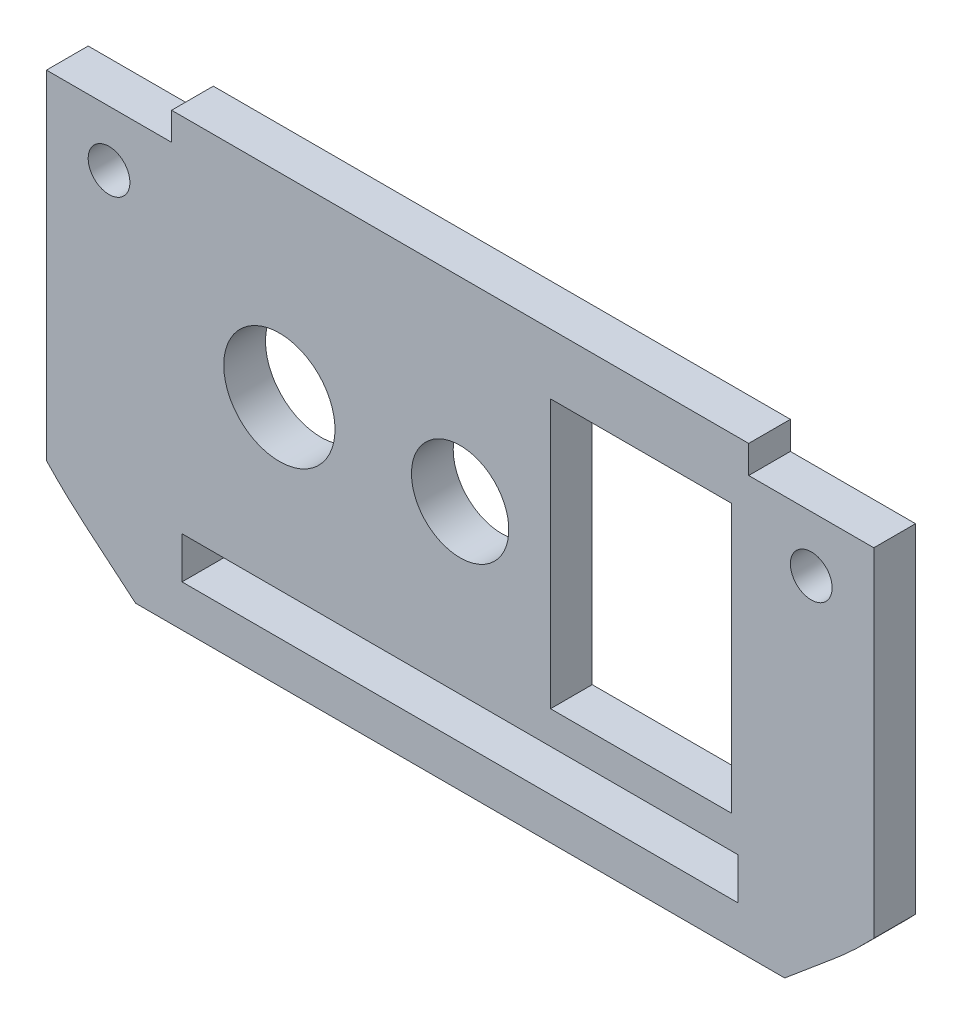
ISO-10303-21;
HEADER;
FILE_DESCRIPTION(('STEP AP214'),'2;1');
FILE_NAME('part.step','',(''),(''),'','','');
FILE_SCHEMA(('AUTOMOTIVE_DESIGN { 1 0 10303 214 1 1 1 1 }'));
ENDSEC;
DATA;
#1=APPLICATION_CONTEXT('core data for automotive mechanical design processes');
#2=APPLICATION_PROTOCOL_DEFINITION('international standard','automotive_design',2000,#1);
#3=PRODUCT_CONTEXT('',#1,'mechanical');
#4=PRODUCT('Part','Part','',(#3));
#5=PRODUCT_RELATED_PRODUCT_CATEGORY('part','',(#4));
#6=PRODUCT_DEFINITION_FORMATION('','',#4);
#7=PRODUCT_DEFINITION_CONTEXT('part definition',#1,'design');
#8=PRODUCT_DEFINITION('design','',#6,#7);
#9=PRODUCT_DEFINITION_SHAPE('','',#8);
#10=(LENGTH_UNIT() NAMED_UNIT(*) SI_UNIT(.MILLI.,.METRE.));
#11=(NAMED_UNIT(*) PLANE_ANGLE_UNIT() SI_UNIT($,.RADIAN.));
#12=(NAMED_UNIT(*) SI_UNIT($,.STERADIAN.) SOLID_ANGLE_UNIT());
#13=UNCERTAINTY_MEASURE_WITH_UNIT(LENGTH_MEASURE(1.E-05),#10,'distance_accuracy_value','');
#14=(GEOMETRIC_REPRESENTATION_CONTEXT(3) GLOBAL_UNCERTAINTY_ASSIGNED_CONTEXT((#13)) GLOBAL_UNIT_ASSIGNED_CONTEXT((#10,
#11,#12)) REPRESENTATION_CONTEXT('',''));
#15=CARTESIAN_POINT('',(0.,0.,0.));
#16=DIRECTION('',(0.,0.,1.));
#17=DIRECTION('',(1.,0.,0.));
#18=AXIS2_PLACEMENT_3D('',#15,#16,#17);
#19=CARTESIAN_POINT('',(-26.9147871056435,19.9999051588187,-64.));
#20=CARTESIAN_POINT('',(-27.7263783854368,20.6837901982728,-64.));
#21=CARTESIAN_POINT('',(-28.5074760571747,21.4052760032748,-64.));
#22=CARTESIAN_POINT('',(-29.6320884436386,22.5455010934507,-64.));
#23=CARTESIAN_POINT('',(-29.9994890597334,22.9357634256907,-64.));
#24=CARTESIAN_POINT('',(-30.7111677982728,23.7276450774803,-64.));
#25=CARTESIAN_POINT('',(-31.056390589223,24.1301732063029,-64.));
#26=CARTESIAN_POINT('',(-32.7307678619733,26.1749150780016,-64.));
#27=CARTESIAN_POINT('',(-33.9054235702185,27.9129911781034,-64.));
#28=CARTESIAN_POINT('',(-35.4370529185161,30.663033957717,-64.));
#29=CARTESIAN_POINT('',(-35.9090631771433,31.6036234918308,-64.));
#30=CARTESIAN_POINT('',(-36.5601593634581,33.0498246354187,-64.));
#31=CARTESIAN_POINT('',(-36.7676964496526,33.5377830619094,-64.));
#32=CARTESIAN_POINT('',(-37.1638236025164,34.5254560338053,-64.));
#33=CARTESIAN_POINT('',(-37.3527321165073,35.0261843238031,-64.));
#34=CARTESIAN_POINT('',(-38.241894145805,37.5356980617039,-64.));
#35=CARTESIAN_POINT('',(-38.783577783586,39.5758711851959,-64.));
#36=CARTESIAN_POINT('',(-39.5680102283546,43.7135954817233,-64.));
#37=CARTESIAN_POINT('',(-39.8105153944841,45.8111934195909,-64.));
#38=CARTESIAN_POINT('',(-39.9359593066346,48.4672964854949,-64.));
#39=CARTESIAN_POINT('',(-39.9520966790366,49.0010057548321,-64.));
#40=CARTESIAN_POINT('',(-39.9665148443424,50.0644891799601,-64.));
#41=CARTESIAN_POINT('',(-39.9648557451864,50.5949815026014,-64.));
#42=CARTESIAN_POINT('',(-39.934049520086,52.1828195733311,-64.));
#43=CARTESIAN_POINT('',(-39.8791184395872,53.2365327602382,-64.));
#44=CARTESIAN_POINT('',(-39.6155682191941,56.3837589870996,-64.));
#45=CARTESIAN_POINT('',(-39.3087856575709,58.4634423162366,-64.));
#46=CARTESIAN_POINT('',(-38.6577427455927,61.5560768044029,-64.));
#47=CARTESIAN_POINT('',(-38.4087641133722,62.5824516866966,-64.));
#48=CARTESIAN_POINT('',(-37.8460178820894,64.6260736859738,-64.));
#49=CARTESIAN_POINT('',(-37.5310957472868,65.6463695367028,-64.));
#50=CARTESIAN_POINT('',(-36.4979772714649,68.6600137755123,-64.));
#51=CARTESIAN_POINT('',(-35.6912963935416,70.6120673433714,-64.));
#52=CARTESIAN_POINT('',(-33.8409200111907,74.4015358865007,-64.));
#53=CARTESIAN_POINT('',(-32.797307350847,76.238990931573,-64.));
#54=CARTESIAN_POINT('',(-31.0399427001826,78.902333742169,-64.));
#55=CARTESIAN_POINT('',(-30.4227353795014,79.7729619306567,-64.));
#56=CARTESIAN_POINT('',(-29.1380523884232,81.4593798872022,-64.));
#57=CARTESIAN_POINT('',(-28.4687965857102,82.2779547463279,-64.));
#58=CARTESIAN_POINT('',(-26.3782730148487,84.6579342874506,-64.));
#59=CARTESIAN_POINT('',(-24.8748626576752,86.1441555247462,-64.));
#60=CARTESIAN_POINT('',(-22.8436515629014,87.8628570149147,-64.));
#61=CARTESIAN_POINT('',(-22.4290326254577,88.2001345055176,-64.));
#62=CARTESIAN_POINT('',(-21.5901963174969,88.8553966799873,-64.));
#63=CARTESIAN_POINT('',(-21.1654767502193,89.1738524529993,-64.));
#64=CARTESIAN_POINT('',(-19.8753255538373,90.1015410843974,-64.));
#65=CARTESIAN_POINT('',(-18.9939253915578,90.6831367258109,-64.));
#66=CARTESIAN_POINT('',(-16.2842870468736,92.3146683963791,-64.));
#67=CARTESIAN_POINT('',(-14.3911136494724,93.2522191108437,-64.));
#68=CARTESIAN_POINT('',(-11.9045766109677,94.2163482662952,-64.));
#69=CARTESIAN_POINT('',(-11.4019550753719,94.3983555555006,-64.));
#70=CARTESIAN_POINT('',(-10.3947386629292,94.7375341044203,-64.));
#71=CARTESIAN_POINT('',(-9.88894348756207,94.8951828230704,-64.));
#72=CARTESIAN_POINT('',(-8.36502593287748,95.3324649862298,-64.));
#73=CARTESIAN_POINT('',(-7.34038135903955,95.5764881306002,-64.));
#74=CARTESIAN_POINT('',(-4.24022566275928,96.1653891272729,-64.));
#75=CARTESIAN_POINT('',(-2.13867647537971,96.3681026659338,-64.));
#76=CARTESIAN_POINT('',(6.19693653909944E-07,96.3681028490923,-64.));
#77=B_SPLINE_CURVE_WITH_KNOTS('',3,(#19,#20,#21,#22,#23,#24,#25,#26,#27,#28,#29,#30,#31,#32,#33,
#34,#35,#36,#37,#38,#39,#40,#41,#42,#43,#44,#45,#46,#47,#48,#49,#50,#51,#52,#53,#54,#55,#56,#57,
#58,#59,#60,#61,#62,#63,#64,#65,#66,#67,#68,#69,#70,#71,#72,#73,#74,#75,#76),.UNSPECIFIED.,.F.,
.F.,(4,2,2,2,2,2,2,2,2,2,2,2,2,2,2,2,2,2,2,2,2,2,2,2,2,2,2,2,4),(0.,0.03125,0.0468750000000001,
0.0625000000000001,0.125,0.15625,0.171875,0.1875,0.25,0.3125,0.328125,0.34375,0.375,0.4375,
0.46875,0.5,0.5625,0.625,0.65625,0.6875,0.75,0.765625,0.78125,0.8125,0.875,0.890625,0.90625,
0.9375,1.),.UNSPECIFIED.);
#78=DIRECTION('',(0.,0.,-1.));
#79=VECTOR('',#78,1.);
#80=SURFACE_OF_LINEAR_EXTRUSION('',#77,#79);
#81=CARTESIAN_POINT('',(-29.75,22.675446625781,-67.));
#82=CARTESIAN_POINT('',(-29.5874373711386,22.5037062389001,-67.));
#83=CARTESIAN_POINT('',(-29.4230585156449,22.3335692568777,-67.));
#84=CARTESIAN_POINT('',(-28.5075107151427,21.4053111423904,-67.));
#85=CARTESIAN_POINT('',(-27.7264506002728,20.6838569019563,-67.));
#86=CARTESIAN_POINT('',(-26.9148996566454,20.,-67.));
#87=B_SPLINE_CURVE_WITH_KNOTS('',3,(#81,#82,#83,#84,#85,#86),.UNSPECIFIED.,.F.,.F.,(4,2,4),
(1.44457972362649E-06,0.00691386236683072,0.0381624177871071),.UNSPECIFIED.);
#88=CARTESIAN_POINT('',(-26.9148996566455,20.,-67.));
#89=VERTEX_POINT('',#88);
#90=CARTESIAN_POINT('',(-29.7500000000001,22.6754466257809,-67.));
#91=VERTEX_POINT('',#90);
#92=EDGE_CURVE('E281',#89,#91,#87,.F.);
#93=ORIENTED_EDGE('',*,*,#92,.F.);
#94=DIRECTION('',(0.,0.,-1.));
#95=VECTOR('',#94,1.);
#96=CARTESIAN_POINT('',(-26.9148996566455,20.,-64.));
#97=LINE('',#96,#95);
#98=CARTESIAN_POINT('',(-26.9148996566455,20.,-64.));
#99=VERTEX_POINT('',#98);
#100=EDGE_CURVE('E11',#99,#89,#97,.T.);
#101=ORIENTED_EDGE('',*,*,#100,.F.);
#102=CARTESIAN_POINT('',(-26.9148996566454,20.,-64.0000000000001));
#103=CARTESIAN_POINT('',(-27.7264506002728,20.6838569019563,-64.0000000000001));
#104=CARTESIAN_POINT('',(-28.5075107151427,21.4053111423904,-64.));
#105=CARTESIAN_POINT('',(-29.4230585156449,22.3335692568777,-64.));
#106=CARTESIAN_POINT('',(-29.5874373711386,22.5037062389001,-64.));
#107=CARTESIAN_POINT('',(-29.75,22.675446625781,-64.));
#108=B_SPLINE_CURVE_WITH_KNOTS('',3,(#102,#103,#104,#105,#106,#107),.UNSPECIFIED.,.F.,.F.,(4,2,
4),(1.44457972362684E-06,0.03125,0.0381624177871071),.UNSPECIFIED.);
#109=CARTESIAN_POINT('',(-29.7500000000001,22.6754466257809,-64.));
#110=VERTEX_POINT('',#109);
#111=EDGE_CURVE('E350',#99,#110,#108,.T.);
#112=ORIENTED_EDGE('',*,*,#111,.T.);
#113=DIRECTION('',(0.,0.,-1.));
#114=VECTOR('',#113,1.);
#115=CARTESIAN_POINT('',(-29.7500000000001,22.6754466257809,-64.));
#116=LINE('',#115,#114);
#117=EDGE_CURVE('E345',#110,#91,#116,.T.);
#118=ORIENTED_EDGE('',*,*,#117,.T.);
#119=EDGE_LOOP('',(#93,#101,#112,#118));
#120=FACE_BOUND('',#119,.T.);
#121=ADVANCED_FACE('F33',(#120),#80,.T.);
#122=CARTESIAN_POINT('',(-23.3396388788628,17.,-64.));
#123=DIRECTION('',(-0.642787609686534,-0.766044443118982,0.));
#124=DIRECTION('',(0.766044443118982,-0.642787609686534,0.));
#125=AXIS2_PLACEMENT_3D('',#122,#123,#124);
#126=PLANE('',#125);
#127=DIRECTION('',(-0.766044443118982,0.642787609686534,0.));
#128=VECTOR('',#127,1.);
#129=CARTESIAN_POINT('',(-23.3396388788628,17.,-67.));
#130=LINE('',#129,#128);
#131=CARTESIAN_POINT('',(-23.3396388788628,17.,-67.));
#132=VERTEX_POINT('',#131);
#133=EDGE_CURVE('E333',#132,#89,#130,.T.);
#134=ORIENTED_EDGE('',*,*,#133,.F.);
#135=DIRECTION('',(0.,0.,-1.));
#136=VECTOR('',#135,1.);
#137=CARTESIAN_POINT('',(-23.3396388788628,17.,-64.));
#138=LINE('',#137,#136);
#139=CARTESIAN_POINT('',(-23.3396388788628,17.,-64.));
#140=VERTEX_POINT('',#139);
#141=EDGE_CURVE('E45',#140,#132,#138,.T.);
#142=ORIENTED_EDGE('',*,*,#141,.F.);
#143=DIRECTION('',(-0.766044443118982,0.642787609686534,0.));
#144=VECTOR('',#143,1.);
#145=CARTESIAN_POINT('',(-23.3396388788628,17.,-64.));
#146=LINE('',#145,#144);
#147=EDGE_CURVE('E312',#140,#99,#146,.T.);
#148=ORIENTED_EDGE('',*,*,#147,.T.);
#149=ORIENTED_EDGE('',*,*,#100,.T.);
#150=EDGE_LOOP('',(#134,#142,#148,#149));
#151=FACE_BOUND('',#150,.T.);
#152=ADVANCED_FACE('F382',(#151),#126,.T.);
#153=CARTESIAN_POINT('',(0.,17.,-64.));
#154=DIRECTION('',(0.,-1.,0.));
#155=DIRECTION('',(1.,0.,0.));
#156=AXIS2_PLACEMENT_3D('',#153,#154,#155);
#157=PLANE('',#156);
#158=DIRECTION('',(-1.,0.,0.));
#159=VECTOR('',#158,1.);
#160=CARTESIAN_POINT('',(0.,17.,-67.));
#161=LINE('',#160,#159);
#162=CARTESIAN_POINT('',(23.3396388788628,17.,-67.));
#163=VERTEX_POINT('',#162);
#164=EDGE_CURVE('E330',#163,#132,#161,.T.);
#165=ORIENTED_EDGE('',*,*,#164,.F.);
#166=DIRECTION('',(0.,0.,-1.));
#167=VECTOR('',#166,1.);
#168=CARTESIAN_POINT('',(23.3396388788628,17.,-64.));
#169=LINE('',#168,#167);
#170=CARTESIAN_POINT('',(23.3396388788628,17.,-64.));
#171=VERTEX_POINT('',#170);
#172=EDGE_CURVE('E443',#171,#163,#169,.T.);
#173=ORIENTED_EDGE('',*,*,#172,.F.);
#174=DIRECTION('',(-1.,0.,0.));
#175=VECTOR('',#174,1.);
#176=CARTESIAN_POINT('',(0.,17.,-64.));
#177=LINE('',#176,#175);
#178=EDGE_CURVE('E309',#171,#140,#177,.T.);
#179=ORIENTED_EDGE('',*,*,#178,.T.);
#180=ORIENTED_EDGE('',*,*,#141,.T.);
#181=EDGE_LOOP('',(#165,#173,#179,#180));
#182=FACE_BOUND('',#181,.T.);
#183=ADVANCED_FACE('F509',(#182),#157,.T.);
#184=CARTESIAN_POINT('',(-20.,20.,-64.));
#185=DIRECTION('',(0.,1.,0.));
#186=DIRECTION('',(0.,0.,1.));
#187=AXIS2_PLACEMENT_3D('',#184,#185,#186);
#188=PLANE('',#187);
#189=DIRECTION('',(1.,0.,0.));
#190=VECTOR('',#189,1.);
#191=CARTESIAN_POINT('',(-20.,20.,-67.));
#192=LINE('',#191,#190);
#193=CARTESIAN_POINT('',(-20.,20.,-67.));
#194=VERTEX_POINT('',#193);
#195=CARTESIAN_POINT('',(20.,20.,-67.));
#196=VERTEX_POINT('',#195);
#197=EDGE_CURVE('E328',#194,#196,#192,.T.);
#198=ORIENTED_EDGE('',*,*,#197,.F.);
#199=DIRECTION('',(0.,0.,-1.));
#200=VECTOR('',#199,1.);
#201=CARTESIAN_POINT('',(-20.,20.,-64.));
#202=LINE('',#201,#200);
#203=CARTESIAN_POINT('',(-20.,20.,-64.));
#204=VERTEX_POINT('',#203);
#205=EDGE_CURVE('E335',#204,#194,#202,.T.);
#206=ORIENTED_EDGE('',*,*,#205,.F.);
#207=DIRECTION('',(1.,0.,0.));
#208=VECTOR('',#207,1.);
#209=CARTESIAN_POINT('',(-20.,20.,-64.));
#210=LINE('',#209,#208);
#211=CARTESIAN_POINT('',(20.,20.,-64.));
#212=VERTEX_POINT('',#211);
#213=EDGE_CURVE('E307',#204,#212,#210,.T.);
#214=ORIENTED_EDGE('',*,*,#213,.T.);
#215=DIRECTION('',(0.,0.,-1.));
#216=VECTOR('',#215,1.);
#217=CARTESIAN_POINT('',(20.,20.,-64.));
#218=LINE('',#217,#216);
#219=EDGE_CURVE('E446',#212,#196,#218,.T.);
#220=ORIENTED_EDGE('',*,*,#219,.T.);
#221=EDGE_LOOP('',(#198,#206,#214,#220));
#222=FACE_BOUND('',#221,.T.);
#223=ADVANCED_FACE('F529',(#222),#188,.T.);
#224=CARTESIAN_POINT('',(-20.,23.,-64.));
#225=DIRECTION('',(1.,0.,0.));
#226=DIRECTION('',(0.,0.,-1.));
#227=AXIS2_PLACEMENT_3D('',#224,#225,#226);
#228=PLANE('',#227);
#229=DIRECTION('',(0.,-1.,0.));
#230=VECTOR('',#229,1.);
#231=CARTESIAN_POINT('',(-20.,23.,-67.));
#232=LINE('',#231,#230);
#233=CARTESIAN_POINT('',(-20.,23.,-67.));
#234=VERTEX_POINT('',#233);
#235=EDGE_CURVE('E325',#234,#194,#232,.T.);
#236=ORIENTED_EDGE('',*,*,#235,.F.);
#237=DIRECTION('',(0.,0.,-1.));
#238=VECTOR('',#237,1.);
#239=CARTESIAN_POINT('',(-20.,23.,-64.));
#240=LINE('',#239,#238);
#241=CARTESIAN_POINT('',(-20.,23.,-64.));
#242=VERTEX_POINT('',#241);
#243=EDGE_CURVE('E337',#242,#234,#240,.T.);
#244=ORIENTED_EDGE('',*,*,#243,.F.);
#245=DIRECTION('',(0.,-1.,0.));
#246=VECTOR('',#245,1.);
#247=CARTESIAN_POINT('',(-20.,23.,-64.));
#248=LINE('',#247,#246);
#249=EDGE_CURVE('E304',#242,#204,#248,.T.);
#250=ORIENTED_EDGE('',*,*,#249,.T.);
#251=ORIENTED_EDGE('',*,*,#205,.T.);
#252=EDGE_LOOP('',(#236,#244,#250,#251));
#253=FACE_BOUND('',#252,.T.);
#254=ADVANCED_FACE('F533',(#253),#228,.T.);
#255=CARTESIAN_POINT('',(0.,23.,-64.));
#256=DIRECTION('',(0.,-1.,0.));
#257=DIRECTION('',(0.,0.,-1.));
#258=AXIS2_PLACEMENT_3D('',#255,#256,#257);
#259=PLANE('',#258);
#260=DIRECTION('',(-1.,0.,0.));
#261=VECTOR('',#260,1.);
#262=CARTESIAN_POINT('',(0.,23.,-67.));
#263=LINE('',#262,#261);
#264=CARTESIAN_POINT('',(20.,23.,-67.));
#265=VERTEX_POINT('',#264);
#266=EDGE_CURVE('E322',#265,#234,#263,.T.);
#267=ORIENTED_EDGE('',*,*,#266,.F.);
#268=DIRECTION('',(0.,0.,-1.));
#269=VECTOR('',#268,1.);
#270=CARTESIAN_POINT('',(20.,23.,-64.));
#271=LINE('',#270,#269);
#272=CARTESIAN_POINT('',(20.,23.,-64.));
#273=VERTEX_POINT('',#272);
#274=EDGE_CURVE('E449',#273,#265,#271,.T.);
#275=ORIENTED_EDGE('',*,*,#274,.F.);
#276=DIRECTION('',(-1.,0.,0.));
#277=VECTOR('',#276,1.);
#278=CARTESIAN_POINT('',(0.,23.,-64.));
#279=LINE('',#278,#277);
#280=EDGE_CURVE('E301',#273,#242,#279,.T.);
#281=ORIENTED_EDGE('',*,*,#280,.T.);
#282=ORIENTED_EDGE('',*,*,#243,.T.);
#283=EDGE_LOOP('',(#267,#275,#281,#282));
#284=FACE_BOUND('',#283,.T.);
#285=ADVANCED_FACE('F539',(#284),#259,.T.);
#286=CARTESIAN_POINT('',(0.,49.,-64.));
#287=DIRECTION('',(0.,1.,0.));
#288=DIRECTION('',(0.,0.,1.));
#289=AXIS2_PLACEMENT_3D('',#286,#287,#288);
#290=PLANE('',#289);
#291=DIRECTION('',(1.,0.,0.));
#292=VECTOR('',#291,1.);
#293=CARTESIAN_POINT('',(0.,49.,-67.));
#294=LINE('',#293,#292);
#295=CARTESIAN_POINT('',(-20.7500000000001,49.,-67.));
#296=VERTEX_POINT('',#295);
#297=CARTESIAN_POINT('',(20.7500000000001,49.,-67.));
#298=VERTEX_POINT('',#297);
#299=EDGE_CURVE('E320',#296,#298,#294,.T.);
#300=ORIENTED_EDGE('',*,*,#299,.F.);
#301=DIRECTION('',(0.,0.,-1.));
#302=VECTOR('',#301,1.);
#303=CARTESIAN_POINT('',(-20.7500000000001,49.,-64.));
#304=LINE('',#303,#302);
#305=CARTESIAN_POINT('',(-20.7500000000001,49.,-64.));
#306=VERTEX_POINT('',#305);
#307=EDGE_CURVE('E339',#306,#296,#304,.T.);
#308=ORIENTED_EDGE('',*,*,#307,.F.);
#309=DIRECTION('',(1.,0.,0.));
#310=VECTOR('',#309,1.);
#311=CARTESIAN_POINT('',(0.,49.,-64.));
#312=LINE('',#311,#310);
#313=CARTESIAN_POINT('',(20.7500000000001,49.,-64.));
#314=VERTEX_POINT('',#313);
#315=EDGE_CURVE('E299',#306,#314,#312,.T.);
#316=ORIENTED_EDGE('',*,*,#315,.T.);
#317=DIRECTION('',(0.,0.,-1.));
#318=VECTOR('',#317,1.);
#319=CARTESIAN_POINT('',(20.7500000000001,49.,-64.));
#320=LINE('',#319,#318);
#321=EDGE_CURVE('E452',#314,#298,#320,.T.);
#322=ORIENTED_EDGE('',*,*,#321,.T.);
#323=EDGE_LOOP('',(#300,#308,#316,#322));
#324=FACE_BOUND('',#323,.T.);
#325=ADVANCED_FACE('F467',(#324),#290,.T.);
#326=CARTESIAN_POINT('',(-20.7500000000001,49.,-64.));
#327=DIRECTION('',(-1.,0.,0.));
#328=DIRECTION('',(0.,-1.,0.));
#329=AXIS2_PLACEMENT_3D('',#326,#327,#328);
#330=PLANE('',#329);
#331=DIRECTION('',(0.,1.,0.));
#332=VECTOR('',#331,1.);
#333=CARTESIAN_POINT('',(-20.7500000000001,49.,-67.));
#334=LINE('',#333,#332);
#335=CARTESIAN_POINT('',(-20.7500000000001,47.,-67.));
#336=VERTEX_POINT('',#335);
#337=EDGE_CURVE('E316',#336,#296,#334,.T.);
#338=ORIENTED_EDGE('',*,*,#337,.F.);
#339=DIRECTION('',(0.,0.,-1.));
#340=VECTOR('',#339,1.);
#341=CARTESIAN_POINT('',(-20.7500000000001,47.,-64.));
#342=LINE('',#341,#340);
#343=CARTESIAN_POINT('',(-20.7500000000001,47.,-64.));
#344=VERTEX_POINT('',#343);
#345=EDGE_CURVE('E341',#344,#336,#342,.T.);
#346=ORIENTED_EDGE('',*,*,#345,.F.);
#347=DIRECTION('',(0.,1.,0.));
#348=VECTOR('',#347,1.);
#349=CARTESIAN_POINT('',(-20.7500000000001,49.,-64.));
#350=LINE('',#349,#348);
#351=EDGE_CURVE('E295',#344,#306,#350,.T.);
#352=ORIENTED_EDGE('',*,*,#351,.T.);
#353=ORIENTED_EDGE('',*,*,#307,.T.);
#354=EDGE_LOOP('',(#338,#346,#352,#353));
#355=FACE_BOUND('',#354,.T.);
#356=ADVANCED_FACE('F471',(#355),#330,.T.);
#357=CARTESIAN_POINT('',(-20.7500000000001,47.,-64.));
#358=DIRECTION('',(0.,1.,0.));
#359=DIRECTION('',(0.,0.,1.));
#360=AXIS2_PLACEMENT_3D('',#357,#358,#359);
#361=PLANE('',#360);
#362=DIRECTION('',(1.,0.,0.));
#363=VECTOR('',#362,1.);
#364=CARTESIAN_POINT('',(-20.7500000000001,47.,-67.));
#365=LINE('',#364,#363);
#366=CARTESIAN_POINT('',(-29.7500000000001,47.,-67.));
#367=VERTEX_POINT('',#366);
#368=EDGE_CURVE('E313',#367,#336,#365,.T.);
#369=ORIENTED_EDGE('',*,*,#368,.F.);
#370=DIRECTION('',(0.,0.,-1.));
#371=VECTOR('',#370,1.);
#372=CARTESIAN_POINT('',(-29.7500000000001,47.,-64.));
#373=LINE('',#372,#371);
#374=CARTESIAN_POINT('',(-29.7500000000001,47.,-64.));
#375=VERTEX_POINT('',#374);
#376=EDGE_CURVE('E343',#375,#367,#373,.T.);
#377=ORIENTED_EDGE('',*,*,#376,.F.);
#378=DIRECTION('',(1.,0.,0.));
#379=VECTOR('',#378,1.);
#380=CARTESIAN_POINT('',(-20.7500000000001,47.,-64.));
#381=LINE('',#380,#379);
#382=EDGE_CURVE('E289',#375,#344,#381,.T.);
#383=ORIENTED_EDGE('',*,*,#382,.T.);
#384=ORIENTED_EDGE('',*,*,#345,.T.);
#385=EDGE_LOOP('',(#369,#377,#383,#384));
#386=FACE_BOUND('',#385,.T.);
#387=ADVANCED_FACE('F474',(#386),#361,.T.);
#388=CARTESIAN_POINT('',(-29.7500000000001,47.,-64.));
#389=DIRECTION('',(-1.,0.,0.));
#390=DIRECTION('',(0.,-1.,0.));
#391=AXIS2_PLACEMENT_3D('',#388,#389,#390);
#392=PLANE('',#391);
#393=DIRECTION('',(0.,1.,0.));
#394=VECTOR('',#393,1.);
#395=CARTESIAN_POINT('',(-29.7500000000001,47.,-67.));
#396=LINE('',#395,#394);
#397=EDGE_CURVE('E317',#91,#367,#396,.T.);
#398=ORIENTED_EDGE('',*,*,#397,.F.);
#399=ORIENTED_EDGE('',*,*,#117,.F.);
#400=DIRECTION('',(0.,1.,0.));
#401=VECTOR('',#400,1.);
#402=CARTESIAN_POINT('',(-29.7500000000001,47.,-64.));
#403=LINE('',#402,#401);
#404=EDGE_CURVE('E296',#110,#375,#403,.T.);
#405=ORIENTED_EDGE('',*,*,#404,.T.);
#406=ORIENTED_EDGE('',*,*,#376,.T.);
#407=EDGE_LOOP('',(#398,#399,#405,#406));
#408=FACE_BOUND('',#407,.T.);
#409=ADVANCED_FACE('F376',(#408),#392,.T.);
#410=CARTESIAN_POINT('',(-37.1867229220128,66.6509176163059,-64.));
#411=DIRECTION('',(0.,0.,-1.));
#412=DIRECTION('',(-1.,0.,0.));
#413=AXIS2_PLACEMENT_3D('',#410,#411,#412);
#414=PLANE('',#413);
#415=DIRECTION('',(-1.,0.,0.));
#416=VECTOR('',#415,1.);
#417=CARTESIAN_POINT('',(19.5,44.65,-64.));
#418=LINE('',#417,#416);
#419=CARTESIAN_POINT('',(19.5,44.65,-64.));
#420=VERTEX_POINT('',#419);
#421=CARTESIAN_POINT('',(6.50000000000001,44.65,-64.));
#422=VERTEX_POINT('',#421);
#423=EDGE_CURVE('E194',#420,#422,#418,.T.);
#424=ORIENTED_EDGE('',*,*,#423,.F.);
#425=DIRECTION('',(0.,1.,0.));
#426=VECTOR('',#425,1.);
#427=CARTESIAN_POINT('',(19.5,44.65,-64.));
#428=LINE('',#427,#426);
#429=CARTESIAN_POINT('',(19.5,25.35,-64.));
#430=VERTEX_POINT('',#429);
#431=EDGE_CURVE('E176',#430,#420,#428,.T.);
#432=ORIENTED_EDGE('',*,*,#431,.F.);
#433=DIRECTION('',(1.,0.,0.));
#434=VECTOR('',#433,1.);
#435=CARTESIAN_POINT('',(19.5,25.35,-64.));
#436=LINE('',#435,#434);
#437=CARTESIAN_POINT('',(6.5,25.35,-64.));
#438=VERTEX_POINT('',#437);
#439=EDGE_CURVE('E185',#438,#430,#436,.T.);
#440=ORIENTED_EDGE('',*,*,#439,.F.);
#441=DIRECTION('',(0.,-1.,0.));
#442=VECTOR('',#441,1.);
#443=CARTESIAN_POINT('',(6.50000000000001,44.65,-64.));
#444=LINE('',#443,#442);
#445=EDGE_CURVE('E53',#422,#438,#444,.T.);
#446=ORIENTED_EDGE('',*,*,#445,.F.);
#447=EDGE_LOOP('',(#424,#432,#440,#446));
#448=FACE_BOUND('',#447,.T.);
#449=CARTESIAN_POINT('',(-13.,35.,-64.));
#450=DIRECTION('',(0.,0.,-1.));
#451=DIRECTION('',(-1.,0.,0.));
#452=AXIS2_PLACEMENT_3D('',#449,#450,#451);
#453=CIRCLE('',#452,4.);
#454=CARTESIAN_POINT('',(-17.,35.,-64.));
#455=VERTEX_POINT('',#454);
#456=EDGE_CURVE('E213',#455,#455,#453,.F.);
#457=ORIENTED_EDGE('',*,*,#456,.F.);
#458=EDGE_LOOP('',(#457));
#459=FACE_BOUND('',#458,.T.);
#460=CARTESIAN_POINT('',(0.,35.,-64.));
#461=DIRECTION('',(0.,0.,-1.));
#462=DIRECTION('',(-1.,0.,0.));
#463=AXIS2_PLACEMENT_3D('',#460,#461,#462);
#464=CIRCLE('',#463,3.5);
#465=CARTESIAN_POINT('',(-3.5,35.,-64.));
#466=VERTEX_POINT('',#465);
#467=EDGE_CURVE('E219',#466,#466,#464,.F.);
#468=ORIENTED_EDGE('',*,*,#467,.F.);
#469=EDGE_LOOP('',(#468));
#470=FACE_BOUND('',#469,.T.);
#471=ORIENTED_EDGE('',*,*,#178,.F.);
#472=DIRECTION('',(0.766044443118982,0.642787609686534,0.));
#473=VECTOR('',#472,1.);
#474=CARTESIAN_POINT('',(23.3396388788628,17.,-64.));
#475=LINE('',#474,#473);
#476=CARTESIAN_POINT('',(26.9148996566455,20.,-64.));
#477=VERTEX_POINT('',#476);
#478=EDGE_CURVE('E408',#171,#477,#475,.T.);
#479=ORIENTED_EDGE('',*,*,#478,.T.);
#480=CARTESIAN_POINT('',(29.75,22.675446625781,-64.));
#481=CARTESIAN_POINT('',(29.5874373711386,22.5037062389001,-64.));
#482=CARTESIAN_POINT('',(29.4230585156449,22.3335692568777,-64.));
#483=CARTESIAN_POINT('',(28.5075107151427,21.4053111423904,-64.));
#484=CARTESIAN_POINT('',(27.7264506002728,20.6838569019563,-64.0000000000001));
#485=CARTESIAN_POINT('',(26.9148996566454,20.,-64.0000000000001));
#486=B_SPLINE_CURVE_WITH_KNOTS('',3,(#480,#481,#482,#483,#484,#485),.UNSPECIFIED.,.F.,.F.,(4,2,
4),(1.44457972362649E-06,0.00691386236683072,0.0381624177871071),.UNSPECIFIED.);
#487=CARTESIAN_POINT('',(29.7500000000001,22.6754466257809,-64.));
#488=VERTEX_POINT('',#487);
#489=EDGE_CURVE('E269',#477,#488,#486,.F.);
#490=ORIENTED_EDGE('',*,*,#489,.T.);
#491=DIRECTION('',(0.,1.,0.));
#492=VECTOR('',#491,1.);
#493=CARTESIAN_POINT('',(29.7500000000001,47.,-64.));
#494=LINE('',#493,#492);
#495=CARTESIAN_POINT('',(29.7500000000001,47.,-64.));
#496=VERTEX_POINT('',#495);
#497=EDGE_CURVE('E405',#488,#496,#494,.T.);
#498=ORIENTED_EDGE('',*,*,#497,.T.);
#499=DIRECTION('',(-1.,0.,0.));
#500=VECTOR('',#499,1.);
#501=CARTESIAN_POINT('',(20.7500000000001,47.,-64.));
#502=LINE('',#501,#500);
#503=CARTESIAN_POINT('',(20.7500000000001,47.,-64.));
#504=VERTEX_POINT('',#503);
#505=EDGE_CURVE('E233',#496,#504,#502,.T.);
#506=ORIENTED_EDGE('',*,*,#505,.T.);
#507=DIRECTION('',(0.,1.,0.));
#508=VECTOR('',#507,1.);
#509=CARTESIAN_POINT('',(20.7500000000001,49.,-64.));
#510=LINE('',#509,#508);
#511=EDGE_CURVE('E427',#504,#314,#510,.T.);
#512=ORIENTED_EDGE('',*,*,#511,.T.);
#513=ORIENTED_EDGE('',*,*,#315,.F.);
#514=ORIENTED_EDGE('',*,*,#351,.F.);
#515=ORIENTED_EDGE('',*,*,#382,.F.);
#516=ORIENTED_EDGE('',*,*,#404,.F.);
#517=ORIENTED_EDGE('',*,*,#111,.F.);
#518=ORIENTED_EDGE('',*,*,#147,.F.);
#519=EDGE_LOOP('',(#471,#479,#490,#498,#506,#512,#513,#514,#515,#516,#517,#518));
#520=FACE_BOUND('',#519,.T.);
#521=CARTESIAN_POINT('',(-25.25,43.,-64.));
#522=DIRECTION('',(0.,0.,-1.));
#523=DIRECTION('',(-1.,0.,0.));
#524=AXIS2_PLACEMENT_3D('',#521,#522,#523);
#525=CIRCLE('',#524,1.5);
#526=CARTESIAN_POINT('',(-26.75,43.,-64.));
#527=VERTEX_POINT('',#526);
#528=EDGE_CURVE('E278',#527,#527,#525,.T.);
#529=ORIENTED_EDGE('',*,*,#528,.T.);
#530=EDGE_LOOP('',(#529));
#531=FACE_BOUND('',#530,.T.);
#532=DIRECTION('',(0.,-1.,0.));
#533=VECTOR('',#532,1.);
#534=CARTESIAN_POINT('',(20.,23.,-64.));
#535=LINE('',#534,#533);
#536=EDGE_CURVE('E419',#273,#212,#535,.T.);
#537=ORIENTED_EDGE('',*,*,#536,.T.);
#538=ORIENTED_EDGE('',*,*,#213,.F.);
#539=ORIENTED_EDGE('',*,*,#249,.F.);
#540=ORIENTED_EDGE('',*,*,#280,.F.);
#541=EDGE_LOOP('',(#537,#538,#539,#540));
#542=FACE_BOUND('',#541,.T.);
#543=CARTESIAN_POINT('',(25.25,43.,-64.));
#544=DIRECTION('',(0.,0.,1.));
#545=DIRECTION('',(1.,0.,0.));
#546=AXIS2_PLACEMENT_3D('',#543,#544,#545);
#547=CIRCLE('',#546,1.5);
#548=CARTESIAN_POINT('',(26.75,43.,-64.));
#549=VERTEX_POINT('',#548);
#550=EDGE_CURVE('E223',#549,#549,#547,.T.);
#551=ORIENTED_EDGE('',*,*,#550,.F.);
#552=EDGE_LOOP('',(#551));
#553=FACE_BOUND('',#552,.T.);
#554=ADVANCED_FACE('F191',(#448,#459,#470,#520,#531,#542,#553),#414,.F.);
#555=CARTESIAN_POINT('',(-37.1867229220128,66.6509176163059,-67.));
#556=DIRECTION('',(0.,0.,-1.));
#557=DIRECTION('',(-1.,0.,0.));
#558=AXIS2_PLACEMENT_3D('',#555,#556,#557);
#559=PLANE('',#558);
#560=DIRECTION('',(0.,-1.,0.));
#561=VECTOR('',#560,1.);
#562=CARTESIAN_POINT('',(19.5,44.65,-67.));
#563=LINE('',#562,#561);
#564=CARTESIAN_POINT('',(19.5,44.65,-67.));
#565=VERTEX_POINT('',#564);
#566=CARTESIAN_POINT('',(19.5,25.35,-67.));
#567=VERTEX_POINT('',#566);
#568=EDGE_CURVE('E61',#565,#567,#563,.T.);
#569=ORIENTED_EDGE('',*,*,#568,.F.);
#570=DIRECTION('',(1.,0.,0.));
#571=VECTOR('',#570,1.);
#572=CARTESIAN_POINT('',(19.5,44.65,-67.));
#573=LINE('',#572,#571);
#574=CARTESIAN_POINT('',(6.50000000000001,44.65,-67.));
#575=VERTEX_POINT('',#574);
#576=EDGE_CURVE('E182',#575,#565,#573,.T.);
#577=ORIENTED_EDGE('',*,*,#576,.F.);
#578=DIRECTION('',(0.,1.,0.));
#579=VECTOR('',#578,1.);
#580=CARTESIAN_POINT('',(6.50000000000001,44.65,-67.));
#581=LINE('',#580,#579);
#582=CARTESIAN_POINT('',(6.5,25.35,-67.));
#583=VERTEX_POINT('',#582);
#584=EDGE_CURVE('E202',#583,#575,#581,.T.);
#585=ORIENTED_EDGE('',*,*,#584,.F.);
#586=DIRECTION('',(-1.,0.,0.));
#587=VECTOR('',#586,1.);
#588=CARTESIAN_POINT('',(19.5,25.35,-67.));
#589=LINE('',#588,#587);
#590=EDGE_CURVE('E196',#567,#583,#589,.T.);
#591=ORIENTED_EDGE('',*,*,#590,.F.);
#592=EDGE_LOOP('',(#569,#577,#585,#591));
#593=FACE_BOUND('',#592,.T.);
#594=CARTESIAN_POINT('',(-13.,35.,-67.));
#595=DIRECTION('',(0.,0.,-1.));
#596=DIRECTION('',(-1.,0.,0.));
#597=AXIS2_PLACEMENT_3D('',#594,#595,#596);
#598=CIRCLE('',#597,4.);
#599=CARTESIAN_POINT('',(-17.,35.,-67.));
#600=VERTEX_POINT('',#599);
#601=EDGE_CURVE('E188',#600,#600,#598,.T.);
#602=ORIENTED_EDGE('',*,*,#601,.F.);
#603=EDGE_LOOP('',(#602));
#604=FACE_BOUND('',#603,.T.);
#605=CARTESIAN_POINT('',(0.,35.,-67.));
#606=DIRECTION('',(0.,0.,-1.));
#607=DIRECTION('',(-1.,0.,0.));
#608=AXIS2_PLACEMENT_3D('',#605,#606,#607);
#609=CIRCLE('',#608,3.5);
#610=CARTESIAN_POINT('',(-3.5,35.,-67.));
#611=VERTEX_POINT('',#610);
#612=EDGE_CURVE('E216',#611,#611,#609,.T.);
#613=ORIENTED_EDGE('',*,*,#612,.F.);
#614=EDGE_LOOP('',(#613));
#615=FACE_BOUND('',#614,.T.);
#616=DIRECTION('',(0.766044443118982,0.642787609686534,0.));
#617=VECTOR('',#616,1.);
#618=CARTESIAN_POINT('',(23.3396388788628,17.,-67.));
#619=LINE('',#618,#617);
#620=CARTESIAN_POINT('',(26.9148996566455,20.,-67.));
#621=VERTEX_POINT('',#620);
#622=EDGE_CURVE('E262',#163,#621,#619,.T.);
#623=ORIENTED_EDGE('',*,*,#622,.F.);
#624=ORIENTED_EDGE('',*,*,#164,.T.);
#625=ORIENTED_EDGE('',*,*,#133,.T.);
#626=ORIENTED_EDGE('',*,*,#92,.T.);
#627=ORIENTED_EDGE('',*,*,#397,.T.);
#628=ORIENTED_EDGE('',*,*,#368,.T.);
#629=ORIENTED_EDGE('',*,*,#337,.T.);
#630=ORIENTED_EDGE('',*,*,#299,.T.);
#631=DIRECTION('',(0.,1.,0.));
#632=VECTOR('',#631,1.);
#633=CARTESIAN_POINT('',(20.7500000000001,49.,-67.));
#634=LINE('',#633,#632);
#635=CARTESIAN_POINT('',(20.7500000000001,47.,-67.));
#636=VERTEX_POINT('',#635);
#637=EDGE_CURVE('E438',#636,#298,#634,.T.);
#638=ORIENTED_EDGE('',*,*,#637,.F.);
#639=DIRECTION('',(-1.,0.,0.));
#640=VECTOR('',#639,1.);
#641=CARTESIAN_POINT('',(20.7500000000001,47.,-67.));
#642=LINE('',#641,#640);
#643=CARTESIAN_POINT('',(29.7500000000001,47.,-67.));
#644=VERTEX_POINT('',#643);
#645=EDGE_CURVE('E275',#644,#636,#642,.T.);
#646=ORIENTED_EDGE('',*,*,#645,.F.);
#647=DIRECTION('',(0.,1.,0.));
#648=VECTOR('',#647,1.);
#649=CARTESIAN_POINT('',(29.7500000000001,47.,-67.));
#650=LINE('',#649,#648);
#651=CARTESIAN_POINT('',(29.7500000000001,22.6754466257809,-67.));
#652=VERTEX_POINT('',#651);
#653=EDGE_CURVE('E273',#652,#644,#650,.T.);
#654=ORIENTED_EDGE('',*,*,#653,.F.);
#655=CARTESIAN_POINT('',(26.9148996566454,20.,-67.));
#656=CARTESIAN_POINT('',(27.7264506002728,20.6838569019563,-67.));
#657=CARTESIAN_POINT('',(28.5075107151427,21.4053111423904,-67.));
#658=CARTESIAN_POINT('',(29.4230585156449,22.3335692568777,-67.));
#659=CARTESIAN_POINT('',(29.5874373711386,22.5037062389001,-67.));
#660=CARTESIAN_POINT('',(29.75,22.675446625781,-67.));
#661=B_SPLINE_CURVE_WITH_KNOTS('',3,(#655,#656,#657,#658,#659,#660),.UNSPECIFIED.,.F.,.F.,(4,2,
4),(1.44457972362684E-06,0.03125,0.0381624177871071),.UNSPECIFIED.);
#662=EDGE_CURVE('E226',#621,#652,#661,.T.);
#663=ORIENTED_EDGE('',*,*,#662,.F.);
#664=EDGE_LOOP('',(#623,#624,#625,#626,#627,#628,#629,#630,#638,#646,#654,#663));
#665=FACE_BOUND('',#664,.T.);
#666=CARTESIAN_POINT('',(-25.25,43.,-67.));
#667=DIRECTION('',(0.,0.,-1.));
#668=DIRECTION('',(-1.,0.,0.));
#669=AXIS2_PLACEMENT_3D('',#666,#667,#668);
#670=CIRCLE('',#669,1.5);
#671=CARTESIAN_POINT('',(-26.75,43.,-67.));
#672=VERTEX_POINT('',#671);
#673=EDGE_CURVE('E282',#672,#672,#670,.T.);
#674=ORIENTED_EDGE('',*,*,#673,.F.);
#675=EDGE_LOOP('',(#674));
#676=FACE_BOUND('',#675,.T.);
#677=ORIENTED_EDGE('',*,*,#197,.T.);
#678=DIRECTION('',(0.,-1.,0.));
#679=VECTOR('',#678,1.);
#680=CARTESIAN_POINT('',(20.,23.,-67.));
#681=LINE('',#680,#679);
#682=EDGE_CURVE('E270',#265,#196,#681,.T.);
#683=ORIENTED_EDGE('',*,*,#682,.F.);
#684=ORIENTED_EDGE('',*,*,#266,.T.);
#685=ORIENTED_EDGE('',*,*,#235,.T.);
#686=EDGE_LOOP('',(#677,#683,#684,#685));
#687=FACE_BOUND('',#686,.T.);
#688=CARTESIAN_POINT('',(25.25,43.,-67.));
#689=DIRECTION('',(0.,0.,1.));
#690=DIRECTION('',(1.,0.,0.));
#691=AXIS2_PLACEMENT_3D('',#688,#689,#690);
#692=CIRCLE('',#691,1.5);
#693=CARTESIAN_POINT('',(26.75,43.,-67.));
#694=VERTEX_POINT('',#693);
#695=EDGE_CURVE('E222',#694,#694,#692,.T.);
#696=ORIENTED_EDGE('',*,*,#695,.T.);
#697=EDGE_LOOP('',(#696));
#698=FACE_BOUND('',#697,.T.);
#699=ADVANCED_FACE('F375',(#593,#604,#615,#665,#676,#687,#698),#559,.T.);
#700=CARTESIAN_POINT('',(-25.25,43.,-64.));
#701=DIRECTION('',(0.,0.,-1.));
#702=DIRECTION('',(-1.,0.,0.));
#703=AXIS2_PLACEMENT_3D('',#700,#701,#702);
#704=CYLINDRICAL_SURFACE('',#703,1.5);
#705=ORIENTED_EDGE('',*,*,#528,.F.);
#706=EDGE_LOOP('',(#705));
#707=FACE_BOUND('',#706,.T.);
#708=ORIENTED_EDGE('',*,*,#673,.T.);
#709=EDGE_LOOP('',(#708));
#710=FACE_BOUND('',#709,.T.);
#711=ADVANCED_FACE('F245',(#707,#710),#704,.F.);
#712=CARTESIAN_POINT('',(26.9147871056435,19.9999051588187,-64.));
#713=CARTESIAN_POINT('',(27.7263783854368,20.6837901982728,-64.));
#714=CARTESIAN_POINT('',(28.5074760571747,21.4052760032748,-64.));
#715=CARTESIAN_POINT('',(29.6320884436386,22.5455010934507,-64.));
#716=CARTESIAN_POINT('',(29.9994890597334,22.9357634256907,-64.));
#717=CARTESIAN_POINT('',(30.7111677982728,23.7276450774803,-64.));
#718=CARTESIAN_POINT('',(31.056390589223,24.1301732063029,-64.));
#719=CARTESIAN_POINT('',(32.7307678619733,26.1749150780016,-64.));
#720=CARTESIAN_POINT('',(33.9054235702185,27.9129911781034,-64.));
#721=CARTESIAN_POINT('',(35.4370529185161,30.663033957717,-64.));
#722=CARTESIAN_POINT('',(35.9090631771433,31.6036234918308,-64.));
#723=CARTESIAN_POINT('',(36.5601593634581,33.0498246354187,-64.));
#724=CARTESIAN_POINT('',(36.7676964496526,33.5377830619094,-64.));
#725=CARTESIAN_POINT('',(37.1638236025164,34.5254560338053,-64.));
#726=CARTESIAN_POINT('',(37.3527321165073,35.0261843238031,-64.));
#727=CARTESIAN_POINT('',(38.241894145805,37.5356980617039,-64.));
#728=CARTESIAN_POINT('',(38.783577783586,39.5758711851959,-64.));
#729=CARTESIAN_POINT('',(39.5680102283546,43.7135954817233,-64.));
#730=CARTESIAN_POINT('',(39.8105153944841,45.8111934195909,-64.));
#731=CARTESIAN_POINT('',(39.9359593066346,48.4672964854949,-64.));
#732=CARTESIAN_POINT('',(39.9520966790366,49.0010057548321,-64.));
#733=CARTESIAN_POINT('',(39.9665148443424,50.0644891799601,-64.));
#734=CARTESIAN_POINT('',(39.9648557451864,50.5949815026014,-64.));
#735=CARTESIAN_POINT('',(39.934049520086,52.1828195733311,-64.));
#736=CARTESIAN_POINT('',(39.8791184395872,53.2365327602382,-64.));
#737=CARTESIAN_POINT('',(39.6155682191941,56.3837589870996,-64.));
#738=CARTESIAN_POINT('',(39.3087856575709,58.4634423162366,-64.));
#739=CARTESIAN_POINT('',(38.6577427455927,61.5560768044029,-64.));
#740=CARTESIAN_POINT('',(38.4087641133722,62.5824516866966,-64.));
#741=CARTESIAN_POINT('',(37.8460178820894,64.6260736859738,-64.));
#742=CARTESIAN_POINT('',(37.5310957472868,65.6463695367028,-64.));
#743=CARTESIAN_POINT('',(36.4979772714649,68.6600137755123,-64.));
#744=CARTESIAN_POINT('',(35.6912963935416,70.6120673433714,-64.));
#745=CARTESIAN_POINT('',(33.8409200111907,74.4015358865007,-64.));
#746=CARTESIAN_POINT('',(32.797307350847,76.238990931573,-64.));
#747=CARTESIAN_POINT('',(31.0399427001826,78.902333742169,-64.));
#748=CARTESIAN_POINT('',(30.4227353795014,79.7729619306567,-64.));
#749=CARTESIAN_POINT('',(29.1380523884232,81.4593798872022,-64.));
#750=CARTESIAN_POINT('',(28.4687965857102,82.2779547463279,-64.));
#751=CARTESIAN_POINT('',(26.3782730148487,84.6579342874506,-64.));
#752=CARTESIAN_POINT('',(24.8748626576752,86.1441555247462,-64.));
#753=CARTESIAN_POINT('',(22.8436515629014,87.8628570149147,-64.));
#754=CARTESIAN_POINT('',(22.4290326254577,88.2001345055176,-64.));
#755=CARTESIAN_POINT('',(21.5901963174969,88.8553966799873,-64.));
#756=CARTESIAN_POINT('',(21.1654767502193,89.1738524529993,-64.));
#757=CARTESIAN_POINT('',(19.8753255538373,90.1015410843974,-64.));
#758=CARTESIAN_POINT('',(18.9939253915578,90.6831367258109,-64.));
#759=CARTESIAN_POINT('',(16.2842870468736,92.3146683963791,-64.));
#760=CARTESIAN_POINT('',(14.3911136494724,93.2522191108437,-64.));
#761=CARTESIAN_POINT('',(11.9045766109677,94.2163482662952,-64.));
#762=CARTESIAN_POINT('',(11.4019550753719,94.3983555555006,-64.));
#763=CARTESIAN_POINT('',(10.3947386629292,94.7375341044203,-64.));
#764=CARTESIAN_POINT('',(9.88894348756207,94.8951828230704,-64.));
#765=CARTESIAN_POINT('',(8.36502593287748,95.3324649862298,-64.));
#766=CARTESIAN_POINT('',(7.34038135903955,95.5764881306002,-64.));
#767=CARTESIAN_POINT('',(4.24022566275928,96.1653891272729,-64.));
#768=CARTESIAN_POINT('',(2.13867647537971,96.3681026659338,-64.));
#769=CARTESIAN_POINT('',(-6.19693653909944E-07,96.3681028490923,-64.));
#770=B_SPLINE_CURVE_WITH_KNOTS('',3,(#712,#713,#714,#715,#716,#717,#718,#719,#720,#721,#722,
#723,#724,#725,#726,#727,#728,#729,#730,#731,#732,#733,#734,#735,#736,#737,#738,#739,#740,#741,
#742,#743,#744,#745,#746,#747,#748,#749,#750,#751,#752,#753,#754,#755,#756,#757,#758,#759,#760,
#761,#762,#763,#764,#765,#766,#767,#768,#769),.UNSPECIFIED.,.F.,.F.,(4,2,2,2,2,2,2,2,2,2,2,2,2,
2,2,2,2,2,2,2,2,2,2,2,2,2,2,2,4),(0.,0.03125,0.0468750000000001,0.0625000000000001,0.125,
0.15625,0.171875,0.1875,0.25,0.3125,0.328125,0.34375,0.375,0.4375,0.46875,0.5,0.5625,0.625,
0.65625,0.6875,0.75,0.765625,0.78125,0.8125,0.875,0.890625,0.90625,0.9375,1.),.UNSPECIFIED.);
#771=DIRECTION('',(0.,0.,-1.));
#772=VECTOR('',#771,1.);
#773=SURFACE_OF_LINEAR_EXTRUSION('',#770,#772);
#774=ORIENTED_EDGE('',*,*,#662,.T.);
#775=DIRECTION('',(0.,0.,-1.));
#776=VECTOR('',#775,1.);
#777=CARTESIAN_POINT('',(29.7500000000001,22.6754466257809,-64.));
#778=LINE('',#777,#776);
#779=EDGE_CURVE('E412',#488,#652,#778,.T.);
#780=ORIENTED_EDGE('',*,*,#779,.F.);
#781=ORIENTED_EDGE('',*,*,#489,.F.);
#782=DIRECTION('',(0.,0.,-1.));
#783=VECTOR('',#782,1.);
#784=CARTESIAN_POINT('',(26.9148996566455,20.,-64.));
#785=LINE('',#784,#783);
#786=EDGE_CURVE('E284',#477,#621,#785,.T.);
#787=ORIENTED_EDGE('',*,*,#786,.T.);
#788=EDGE_LOOP('',(#774,#780,#781,#787));
#789=FACE_BOUND('',#788,.T.);
#790=ADVANCED_FACE('F239',(#789),#773,.F.);
#791=CARTESIAN_POINT('',(23.3396388788628,17.,-64.));
#792=DIRECTION('',(0.642787609686534,-0.766044443118982,0.));
#793=DIRECTION('',(-0.766044443118982,-0.642787609686534,0.));
#794=AXIS2_PLACEMENT_3D('',#791,#792,#793);
#795=PLANE('',#794);
#796=ORIENTED_EDGE('',*,*,#622,.T.);
#797=ORIENTED_EDGE('',*,*,#786,.F.);
#798=ORIENTED_EDGE('',*,*,#478,.F.);
#799=ORIENTED_EDGE('',*,*,#172,.T.);
#800=EDGE_LOOP('',(#796,#797,#798,#799));
#801=FACE_BOUND('',#800,.T.);
#802=ADVANCED_FACE('F244',(#801),#795,.T.);
#803=CARTESIAN_POINT('',(20.,23.,-64.));
#804=DIRECTION('',(-1.,0.,0.));
#805=DIRECTION('',(0.,0.,-1.));
#806=AXIS2_PLACEMENT_3D('',#803,#804,#805);
#807=PLANE('',#806);
#808=ORIENTED_EDGE('',*,*,#682,.T.);
#809=ORIENTED_EDGE('',*,*,#219,.F.);
#810=ORIENTED_EDGE('',*,*,#536,.F.);
#811=ORIENTED_EDGE('',*,*,#274,.T.);
#812=EDGE_LOOP('',(#808,#809,#810,#811));
#813=FACE_BOUND('',#812,.T.);
#814=ADVANCED_FACE('F520',(#813),#807,.T.);
#815=CARTESIAN_POINT('',(20.7500000000001,49.,-64.));
#816=DIRECTION('',(1.,0.,0.));
#817=DIRECTION('',(0.,-1.,0.));
#818=AXIS2_PLACEMENT_3D('',#815,#816,#817);
#819=PLANE('',#818);
#820=ORIENTED_EDGE('',*,*,#637,.T.);
#821=ORIENTED_EDGE('',*,*,#321,.F.);
#822=ORIENTED_EDGE('',*,*,#511,.F.);
#823=DIRECTION('',(0.,0.,-1.));
#824=VECTOR('',#823,1.);
#825=CARTESIAN_POINT('',(20.7500000000001,47.,-64.));
#826=LINE('',#825,#824);
#827=EDGE_CURVE('E417',#504,#636,#826,.T.);
#828=ORIENTED_EDGE('',*,*,#827,.T.);
#829=EDGE_LOOP('',(#820,#821,#822,#828));
#830=FACE_BOUND('',#829,.T.);
#831=ADVANCED_FACE('F458',(#830),#819,.T.);
#832=CARTESIAN_POINT('',(20.7500000000001,47.,-64.));
#833=DIRECTION('',(0.,1.,0.));
#834=DIRECTION('',(0.,0.,1.));
#835=AXIS2_PLACEMENT_3D('',#832,#833,#834);
#836=PLANE('',#835);
#837=ORIENTED_EDGE('',*,*,#645,.T.);
#838=ORIENTED_EDGE('',*,*,#827,.F.);
#839=ORIENTED_EDGE('',*,*,#505,.F.);
#840=DIRECTION('',(0.,0.,-1.));
#841=VECTOR('',#840,1.);
#842=CARTESIAN_POINT('',(29.7500000000001,47.,-64.));
#843=LINE('',#842,#841);
#844=EDGE_CURVE('E414',#496,#644,#843,.T.);
#845=ORIENTED_EDGE('',*,*,#844,.T.);
#846=EDGE_LOOP('',(#837,#838,#839,#845));
#847=FACE_BOUND('',#846,.T.);
#848=ADVANCED_FACE('F513',(#847),#836,.T.);
#849=CARTESIAN_POINT('',(29.7500000000001,47.,-64.));
#850=DIRECTION('',(1.,0.,0.));
#851=DIRECTION('',(0.,-1.,0.));
#852=AXIS2_PLACEMENT_3D('',#849,#850,#851);
#853=PLANE('',#852);
#854=ORIENTED_EDGE('',*,*,#653,.T.);
#855=ORIENTED_EDGE('',*,*,#844,.F.);
#856=ORIENTED_EDGE('',*,*,#497,.F.);
#857=ORIENTED_EDGE('',*,*,#779,.T.);
#858=EDGE_LOOP('',(#854,#855,#856,#857));
#859=FACE_BOUND('',#858,.T.);
#860=ADVANCED_FACE('F247',(#859),#853,.T.);
#861=CARTESIAN_POINT('',(25.25,43.,-64.));
#862=DIRECTION('',(0.,0.,-1.));
#863=DIRECTION('',(1.,0.,0.));
#864=AXIS2_PLACEMENT_3D('',#861,#862,#863);
#865=CYLINDRICAL_SURFACE('',#864,1.5);
#866=ORIENTED_EDGE('',*,*,#550,.T.);
#867=EDGE_LOOP('',(#866));
#868=FACE_BOUND('',#867,.T.);
#869=ORIENTED_EDGE('',*,*,#695,.F.);
#870=EDGE_LOOP('',(#869));
#871=FACE_BOUND('',#870,.T.);
#872=ADVANCED_FACE('F519',(#868,#871),#865,.F.);
#873=CARTESIAN_POINT('',(0.,35.,140.579004563076));
#874=DIRECTION('',(0.,0.,-1.));
#875=DIRECTION('',(-1.,0.,0.));
#876=AXIS2_PLACEMENT_3D('',#873,#874,#875);
#877=CYLINDRICAL_SURFACE('',#876,3.5);
#878=ORIENTED_EDGE('',*,*,#612,.T.);
#879=EDGE_LOOP('',(#878));
#880=FACE_BOUND('',#879,.T.);
#881=ORIENTED_EDGE('',*,*,#467,.T.);
#882=EDGE_LOOP('',(#881));
#883=FACE_BOUND('',#882,.T.);
#884=ADVANCED_FACE('F618',(#880,#883),#877,.F.);
#885=CARTESIAN_POINT('',(-13.,35.,140.579004563076));
#886=DIRECTION('',(0.,0.,-1.));
#887=DIRECTION('',(-1.,0.,0.));
#888=AXIS2_PLACEMENT_3D('',#885,#886,#887);
#889=CYLINDRICAL_SURFACE('',#888,4.);
#890=ORIENTED_EDGE('',*,*,#601,.T.);
#891=EDGE_LOOP('',(#890));
#892=FACE_BOUND('',#891,.T.);
#893=ORIENTED_EDGE('',*,*,#456,.T.);
#894=EDGE_LOOP('',(#893));
#895=FACE_BOUND('',#894,.T.);
#896=ADVANCED_FACE('F628',(#892,#895),#889,.F.);
#897=CARTESIAN_POINT('',(19.5,44.65,140.579004563076));
#898=DIRECTION('',(1.,0.,0.));
#899=DIRECTION('',(0.,0.,-1.));
#900=AXIS2_PLACEMENT_3D('',#897,#898,#899);
#901=PLANE('',#900);
#902=ORIENTED_EDGE('',*,*,#431,.T.);
#903=DIRECTION('',(0.,0.,-1.));
#904=VECTOR('',#903,1.);
#905=CARTESIAN_POINT('',(19.5,44.65,140.579004563076));
#906=LINE('',#905,#904);
#907=EDGE_CURVE('E189',#420,#565,#906,.T.);
#908=ORIENTED_EDGE('',*,*,#907,.T.);
#909=ORIENTED_EDGE('',*,*,#568,.T.);
#910=DIRECTION('',(0.,0.,-1.));
#911=VECTOR('',#910,1.);
#912=CARTESIAN_POINT('',(19.5,25.35,140.579004563076));
#913=LINE('',#912,#911);
#914=EDGE_CURVE('E172',#430,#567,#913,.T.);
#915=ORIENTED_EDGE('',*,*,#914,.F.);
#916=EDGE_LOOP('',(#902,#908,#909,#915));
#917=FACE_BOUND('',#916,.T.);
#918=ADVANCED_FACE('F174',(#917),#901,.F.);
#919=CARTESIAN_POINT('',(19.5,44.65,140.579004563076));
#920=DIRECTION('',(0.,1.,0.));
#921=DIRECTION('',(0.,0.,1.));
#922=AXIS2_PLACEMENT_3D('',#919,#920,#921);
#923=PLANE('',#922);
#924=ORIENTED_EDGE('',*,*,#423,.T.);
#925=DIRECTION('',(0.,0.,-1.));
#926=VECTOR('',#925,1.);
#927=CARTESIAN_POINT('',(6.50000000000001,44.65,140.579004563076));
#928=LINE('',#927,#926);
#929=EDGE_CURVE('E208',#422,#575,#928,.T.);
#930=ORIENTED_EDGE('',*,*,#929,.T.);
#931=ORIENTED_EDGE('',*,*,#576,.T.);
#932=ORIENTED_EDGE('',*,*,#907,.F.);
#933=EDGE_LOOP('',(#924,#930,#931,#932));
#934=FACE_BOUND('',#933,.T.);
#935=ADVANCED_FACE('F647',(#934),#923,.F.);
#936=CARTESIAN_POINT('',(6.50000000000001,44.65,140.579004563076));
#937=DIRECTION('',(-1.,0.,0.));
#938=DIRECTION('',(0.,-1.,0.));
#939=AXIS2_PLACEMENT_3D('',#936,#937,#938);
#940=PLANE('',#939);
#941=ORIENTED_EDGE('',*,*,#445,.T.);
#942=DIRECTION('',(0.,0.,-1.));
#943=VECTOR('',#942,1.);
#944=CARTESIAN_POINT('',(6.5,25.35,140.579004563076));
#945=LINE('',#944,#943);
#946=EDGE_CURVE('E181',#438,#583,#945,.T.);
#947=ORIENTED_EDGE('',*,*,#946,.T.);
#948=ORIENTED_EDGE('',*,*,#584,.T.);
#949=ORIENTED_EDGE('',*,*,#929,.F.);
#950=EDGE_LOOP('',(#941,#947,#948,#949));
#951=FACE_BOUND('',#950,.T.);
#952=ADVANCED_FACE('F657',(#951),#940,.F.);
#953=CARTESIAN_POINT('',(19.5,25.35,140.579004563076));
#954=DIRECTION('',(0.,-1.,0.));
#955=DIRECTION('',(1.,0.,0.));
#956=AXIS2_PLACEMENT_3D('',#953,#954,#955);
#957=PLANE('',#956);
#958=ORIENTED_EDGE('',*,*,#439,.T.);
#959=ORIENTED_EDGE('',*,*,#914,.T.);
#960=ORIENTED_EDGE('',*,*,#590,.T.);
#961=ORIENTED_EDGE('',*,*,#946,.F.);
#962=EDGE_LOOP('',(#958,#959,#960,#961));
#963=FACE_BOUND('',#962,.T.);
#964=ADVANCED_FACE('F186',(#963),#957,.F.);
#965=CLOSED_SHELL('',(#121,#152,#183,#223,#254,#285,#325,#356,#387,#409,#554,#699,#711,#790,
#802,#814,#831,#848,#860,#872,#884,#896,#918,#935,#952,#964));
#966=MANIFOLD_SOLID_BREP('B2',#965);
#967=ADVANCED_BREP_SHAPE_REPRESENTATION('',(#18,#966),#14);
#968=SHAPE_DEFINITION_REPRESENTATION(#9,#967);
ENDSEC;
END-ISO-10303-21;
